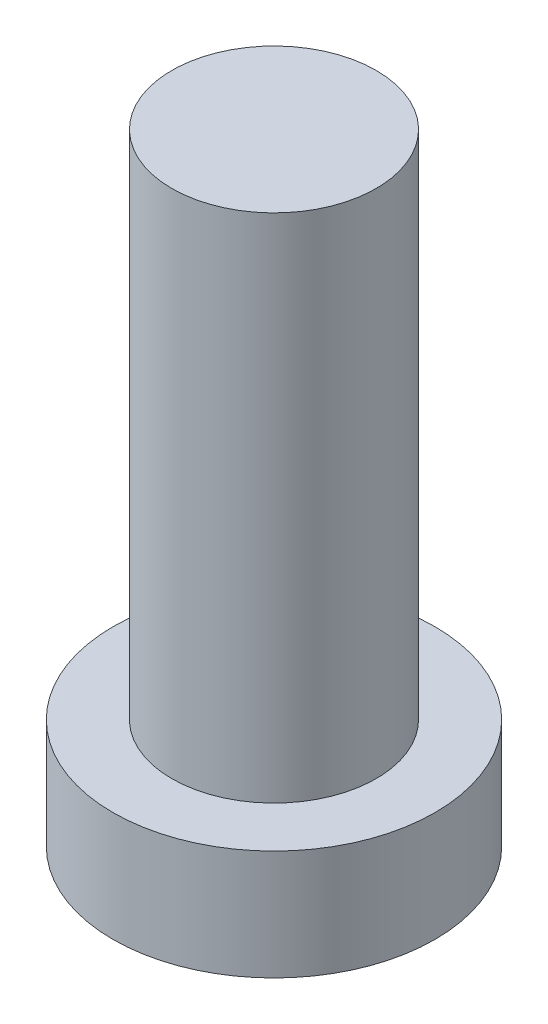
ISO-10303-21;
HEADER;
FILE_DESCRIPTION(('STEP AP214'),'2;1');
FILE_NAME('part.step','',(''),(''),'','','');
FILE_SCHEMA(('AUTOMOTIVE_DESIGN { 1 0 10303 214 1 1 1 1 }'));
ENDSEC;
DATA;
#1=APPLICATION_CONTEXT('core data for automotive mechanical design processes');
#2=APPLICATION_PROTOCOL_DEFINITION('international standard','automotive_design',2000,#1);
#3=PRODUCT_CONTEXT('',#1,'mechanical');
#4=PRODUCT('Part','Part','',(#3));
#5=PRODUCT_RELATED_PRODUCT_CATEGORY('part','',(#4));
#6=PRODUCT_DEFINITION_FORMATION('','',#4);
#7=PRODUCT_DEFINITION_CONTEXT('part definition',#1,'design');
#8=PRODUCT_DEFINITION('design','',#6,#7);
#9=PRODUCT_DEFINITION_SHAPE('','',#8);
#10=(LENGTH_UNIT() NAMED_UNIT(*) SI_UNIT(.MILLI.,.METRE.));
#11=(NAMED_UNIT(*) PLANE_ANGLE_UNIT() SI_UNIT($,.RADIAN.));
#12=(NAMED_UNIT(*) SI_UNIT($,.STERADIAN.) SOLID_ANGLE_UNIT());
#13=UNCERTAINTY_MEASURE_WITH_UNIT(LENGTH_MEASURE(1.E-05),#10,'distance_accuracy_value','');
#14=(GEOMETRIC_REPRESENTATION_CONTEXT(3) GLOBAL_UNCERTAINTY_ASSIGNED_CONTEXT((#13)) GLOBAL_UNIT_ASSIGNED_CONTEXT((#10,
#11,#12)) REPRESENTATION_CONTEXT('',''));
#15=CARTESIAN_POINT('',(0.,0.,0.));
#16=DIRECTION('',(0.,0.,1.));
#17=DIRECTION('',(1.,0.,0.));
#18=AXIS2_PLACEMENT_3D('',#15,#16,#17);
#19=CARTESIAN_POINT('',(0.,0.,0.));
#20=DIRECTION('',(0.,1.,0.));
#21=DIRECTION('',(0.,0.,1.));
#22=AXIS2_PLACEMENT_3D('',#19,#20,#21);
#23=PLANE('',#22);
#24=CARTESIAN_POINT('',(0.,0.,0.));
#25=DIRECTION('',(0.,1.,0.));
#26=DIRECTION('',(0.,0.,1.));
#27=AXIS2_PLACEMENT_3D('',#24,#25,#26);
#28=CIRCLE('',#27,3.15);
#29=CARTESIAN_POINT('',(0.,0.,3.15));
#30=VERTEX_POINT('',#29);
#31=EDGE_CURVE('E39',#30,#30,#28,.T.);
#32=ORIENTED_EDGE('',*,*,#31,.F.);
#33=EDGE_LOOP('',(#32));
#34=FACE_BOUND('',#33,.T.);
#35=CARTESIAN_POINT('',(1.,0.,1.));
#36=DIRECTION('',(0.,1.,0.));
#37=DIRECTION('',(0.,0.,-1.));
#38=AXIS2_PLACEMENT_3D('',#35,#36,#37);
#39=CIRCLE('',#38,0.5);
#40=CARTESIAN_POINT('',(1.,0.,0.5));
#41=VERTEX_POINT('',#40);
#42=CARTESIAN_POINT('',(0.5,0.,1.));
#43=VERTEX_POINT('',#42);
#44=EDGE_CURVE('E186',#41,#43,#39,.T.);
#45=ORIENTED_EDGE('',*,*,#44,.F.);
#46=DIRECTION('',(-1.,0.,0.));
#47=VECTOR('',#46,1.);
#48=CARTESIAN_POINT('',(1.,0.,0.5));
#49=LINE('',#48,#47);
#50=CARTESIAN_POINT('',(2.,0.,0.5));
#51=VERTEX_POINT('',#50);
#52=EDGE_CURVE('E52',#51,#41,#49,.T.);
#53=ORIENTED_EDGE('',*,*,#52,.F.);
#54=DIRECTION('',(0.,0.,1.));
#55=VECTOR('',#54,1.);
#56=CARTESIAN_POINT('',(2.,0.,-0.5));
#57=LINE('',#56,#55);
#58=CARTESIAN_POINT('',(2.,0.,-0.5));
#59=VERTEX_POINT('',#58);
#60=EDGE_CURVE('E225',#59,#51,#57,.T.);
#61=ORIENTED_EDGE('',*,*,#60,.F.);
#62=DIRECTION('',(1.,0.,0.));
#63=VECTOR('',#62,1.);
#64=CARTESIAN_POINT('',(1.,0.,-0.5));
#65=LINE('',#64,#63);
#66=CARTESIAN_POINT('',(1.,0.,-0.5));
#67=VERTEX_POINT('',#66);
#68=EDGE_CURVE('E223',#67,#59,#65,.T.);
#69=ORIENTED_EDGE('',*,*,#68,.F.);
#70=CARTESIAN_POINT('',(1.,0.,-1.));
#71=DIRECTION('',(0.,1.,0.));
#72=DIRECTION('',(0.,0.,-1.));
#73=AXIS2_PLACEMENT_3D('',#70,#71,#72);
#74=CIRCLE('',#73,0.5);
#75=CARTESIAN_POINT('',(0.500000000000001,0.,-1.));
#76=VERTEX_POINT('',#75);
#77=EDGE_CURVE('E160',#76,#67,#74,.T.);
#78=ORIENTED_EDGE('',*,*,#77,.F.);
#79=DIRECTION('',(0.,0.,1.));
#80=VECTOR('',#79,1.);
#81=CARTESIAN_POINT('',(0.500000000000001,0.,-2.));
#82=LINE('',#81,#80);
#83=CARTESIAN_POINT('',(0.500000000000001,0.,-2.));
#84=VERTEX_POINT('',#83);
#85=EDGE_CURVE('E219',#84,#76,#82,.T.);
#86=ORIENTED_EDGE('',*,*,#85,.F.);
#87=DIRECTION('',(1.,0.,0.));
#88=VECTOR('',#87,1.);
#89=CARTESIAN_POINT('',(-0.5,0.,-2.));
#90=LINE('',#89,#88);
#91=CARTESIAN_POINT('',(-0.5,0.,-2.));
#92=VERTEX_POINT('',#91);
#93=EDGE_CURVE('E216',#92,#84,#90,.T.);
#94=ORIENTED_EDGE('',*,*,#93,.F.);
#95=DIRECTION('',(0.,0.,-1.));
#96=VECTOR('',#95,1.);
#97=CARTESIAN_POINT('',(-0.5,0.,-2.));
#98=LINE('',#97,#96);
#99=CARTESIAN_POINT('',(-0.5,0.,-1.));
#100=VERTEX_POINT('',#99);
#101=EDGE_CURVE('E213',#100,#92,#98,.T.);
#102=ORIENTED_EDGE('',*,*,#101,.F.);
#103=CARTESIAN_POINT('',(-1.,0.,-1.));
#104=DIRECTION('',(0.,1.,0.));
#105=DIRECTION('',(0.,0.,-1.));
#106=AXIS2_PLACEMENT_3D('',#103,#104,#105);
#107=CIRCLE('',#106,0.5);
#108=CARTESIAN_POINT('',(-1.,0.,-0.5));
#109=VERTEX_POINT('',#108);
#110=EDGE_CURVE('E210',#109,#100,#107,.T.);
#111=ORIENTED_EDGE('',*,*,#110,.F.);
#112=DIRECTION('',(1.,0.,0.));
#113=VECTOR('',#112,1.);
#114=CARTESIAN_POINT('',(-2.,0.,-0.5));
#115=LINE('',#114,#113);
#116=CARTESIAN_POINT('',(-2.,0.,-0.5));
#117=VERTEX_POINT('',#116);
#118=EDGE_CURVE('E207',#117,#109,#115,.T.);
#119=ORIENTED_EDGE('',*,*,#118,.F.);
#120=DIRECTION('',(0.,0.,-1.));
#121=VECTOR('',#120,1.);
#122=CARTESIAN_POINT('',(-2.,0.,-0.5));
#123=LINE('',#122,#121);
#124=CARTESIAN_POINT('',(-2.,0.,0.5));
#125=VERTEX_POINT('',#124);
#126=EDGE_CURVE('E204',#125,#117,#123,.T.);
#127=ORIENTED_EDGE('',*,*,#126,.F.);
#128=DIRECTION('',(-1.,0.,0.));
#129=VECTOR('',#128,1.);
#130=CARTESIAN_POINT('',(-2.,0.,0.5));
#131=LINE('',#130,#129);
#132=CARTESIAN_POINT('',(-1.,0.,0.5));
#133=VERTEX_POINT('',#132);
#134=EDGE_CURVE('E201',#133,#125,#131,.T.);
#135=ORIENTED_EDGE('',*,*,#134,.F.);
#136=CARTESIAN_POINT('',(-1.,0.,1.));
#137=DIRECTION('',(0.,1.,0.));
#138=DIRECTION('',(0.,0.,1.));
#139=AXIS2_PLACEMENT_3D('',#136,#137,#138);
#140=CIRCLE('',#139,0.5);
#141=CARTESIAN_POINT('',(-0.5,0.,1.));
#142=VERTEX_POINT('',#141);
#143=EDGE_CURVE('E198',#142,#133,#140,.T.);
#144=ORIENTED_EDGE('',*,*,#143,.F.);
#145=DIRECTION('',(0.,0.,-1.));
#146=VECTOR('',#145,1.);
#147=CARTESIAN_POINT('',(-0.5,0.,1.));
#148=LINE('',#147,#146);
#149=CARTESIAN_POINT('',(-0.5,0.,2.));
#150=VERTEX_POINT('',#149);
#151=EDGE_CURVE('E195',#150,#142,#148,.T.);
#152=ORIENTED_EDGE('',*,*,#151,.F.);
#153=DIRECTION('',(-1.,0.,0.));
#154=VECTOR('',#153,1.);
#155=CARTESIAN_POINT('',(-0.5,0.,2.));
#156=LINE('',#155,#154);
#157=CARTESIAN_POINT('',(0.500000000000001,0.,2.));
#158=VERTEX_POINT('',#157);
#159=EDGE_CURVE('E192',#158,#150,#156,.T.);
#160=ORIENTED_EDGE('',*,*,#159,.F.);
#161=DIRECTION('',(0.,0.,1.));
#162=VECTOR('',#161,1.);
#163=CARTESIAN_POINT('',(0.5,0.,1.));
#164=LINE('',#163,#162);
#165=EDGE_CURVE('E189',#43,#158,#164,.T.);
#166=ORIENTED_EDGE('',*,*,#165,.F.);
#167=EDGE_LOOP('',(#45,#53,#61,#69,#78,#86,#94,#102,#111,#119,#127,#135,#144,#152,#160,#166));
#168=FACE_BOUND('',#167,.T.);
#169=ADVANCED_FACE('F35',(#34,#168),#23,.F.);
#170=CARTESIAN_POINT('',(0.,2.15,0.));
#171=DIRECTION('',(0.,-1.,0.));
#172=DIRECTION('',(0.,0.,-1.));
#173=AXIS2_PLACEMENT_3D('',#170,#171,#172);
#174=CYLINDRICAL_SURFACE('',#173,3.15);
#175=CARTESIAN_POINT('',(0.,2.15,0.));
#176=DIRECTION('',(0.,1.,0.));
#177=DIRECTION('',(0.,0.,1.));
#178=AXIS2_PLACEMENT_3D('',#175,#176,#177);
#179=CIRCLE('',#178,3.15);
#180=CARTESIAN_POINT('',(0.,2.15,3.15));
#181=VERTEX_POINT('',#180);
#182=EDGE_CURVE('E44',#181,#181,#179,.T.);
#183=ORIENTED_EDGE('',*,*,#182,.F.);
#184=EDGE_LOOP('',(#183));
#185=FACE_BOUND('',#184,.T.);
#186=ORIENTED_EDGE('',*,*,#31,.T.);
#187=EDGE_LOOP('',(#186));
#188=FACE_BOUND('',#187,.T.);
#189=ADVANCED_FACE('F37',(#185,#188),#174,.T.);
#190=CARTESIAN_POINT('',(0.,2.15,0.));
#191=DIRECTION('',(0.,1.,0.));
#192=DIRECTION('',(0.,0.,1.));
#193=AXIS2_PLACEMENT_3D('',#190,#191,#192);
#194=PLANE('',#193);
#195=CARTESIAN_POINT('',(0.,2.15,0.));
#196=DIRECTION('',(0.,1.,0.));
#197=DIRECTION('',(0.,0.,1.));
#198=AXIS2_PLACEMENT_3D('',#195,#196,#197);
#199=CIRCLE('',#198,2.);
#200=CARTESIAN_POINT('',(0.,2.15,2.));
#201=VERTEX_POINT('',#200);
#202=EDGE_CURVE('E11',#201,#201,#199,.T.);
#203=ORIENTED_EDGE('',*,*,#202,.F.);
#204=EDGE_LOOP('',(#203));
#205=FACE_BOUND('',#204,.T.);
#206=ORIENTED_EDGE('',*,*,#182,.T.);
#207=EDGE_LOOP('',(#206));
#208=FACE_BOUND('',#207,.T.);
#209=ADVANCED_FACE('F374',(#205,#208),#194,.T.);
#210=CARTESIAN_POINT('',(0.,12.15,0.));
#211=DIRECTION('',(0.,-1.,0.));
#212=DIRECTION('',(0.,0.,-1.));
#213=AXIS2_PLACEMENT_3D('',#210,#211,#212);
#214=CYLINDRICAL_SURFACE('',#213,2.);
#215=CARTESIAN_POINT('',(0.,12.15,0.));
#216=DIRECTION('',(0.,1.,0.));
#217=DIRECTION('',(0.,0.,1.));
#218=AXIS2_PLACEMENT_3D('',#215,#216,#217);
#219=CIRCLE('',#218,2.);
#220=CARTESIAN_POINT('',(0.,12.15,2.));
#221=VERTEX_POINT('',#220);
#222=EDGE_CURVE('E229',#221,#221,#219,.T.);
#223=ORIENTED_EDGE('',*,*,#222,.F.);
#224=EDGE_LOOP('',(#223));
#225=FACE_BOUND('',#224,.T.);
#226=ORIENTED_EDGE('',*,*,#202,.T.);
#227=EDGE_LOOP('',(#226));
#228=FACE_BOUND('',#227,.T.);
#229=ADVANCED_FACE('F370',(#225,#228),#214,.T.);
#230=CARTESIAN_POINT('',(0.,12.15,0.));
#231=DIRECTION('',(0.,1.,0.));
#232=DIRECTION('',(0.,0.,1.));
#233=AXIS2_PLACEMENT_3D('',#230,#231,#232);
#234=PLANE('',#233);
#235=ORIENTED_EDGE('',*,*,#222,.T.);
#236=EDGE_LOOP('',(#235));
#237=FACE_BOUND('',#236,.T.);
#238=ADVANCED_FACE('F320',(#237),#234,.T.);
#239=CARTESIAN_POINT('',(1.,1.5,0.5));
#240=DIRECTION('',(0.,0.,1.));
#241=DIRECTION('',(1.,0.,0.));
#242=AXIS2_PLACEMENT_3D('',#239,#240,#241);
#243=PLANE('',#242);
#244=ORIENTED_EDGE('',*,*,#52,.T.);
#245=DIRECTION('',(0.,-1.,0.));
#246=VECTOR('',#245,1.);
#247=CARTESIAN_POINT('',(1.,1.5,0.5));
#248=LINE('',#247,#246);
#249=CARTESIAN_POINT('',(1.,1.5,0.5));
#250=VERTEX_POINT('',#249);
#251=EDGE_CURVE('E112',#250,#41,#248,.T.);
#252=ORIENTED_EDGE('',*,*,#251,.F.);
#253=DIRECTION('',(-1.,0.,0.));
#254=VECTOR('',#253,1.);
#255=CARTESIAN_POINT('',(1.,1.5,0.5));
#256=LINE('',#255,#254);
#257=CARTESIAN_POINT('',(2.,1.5,0.5));
#258=VERTEX_POINT('',#257);
#259=EDGE_CURVE('E227',#258,#250,#256,.T.);
#260=ORIENTED_EDGE('',*,*,#259,.F.);
#261=DIRECTION('',(0.,-1.,0.));
#262=VECTOR('',#261,1.);
#263=CARTESIAN_POINT('',(2.,1.5,0.5));
#264=LINE('',#263,#262);
#265=EDGE_CURVE('E60',#258,#51,#264,.T.);
#266=ORIENTED_EDGE('',*,*,#265,.T.);
#267=EDGE_LOOP('',(#244,#252,#260,#266));
#268=FACE_BOUND('',#267,.T.);
#269=ADVANCED_FACE('F313',(#268),#243,.F.);
#270=CARTESIAN_POINT('',(2.,1.5,-0.5));
#271=DIRECTION('',(1.,0.,0.));
#272=DIRECTION('',(0.,0.,-1.));
#273=AXIS2_PLACEMENT_3D('',#270,#271,#272);
#274=PLANE('',#273);
#275=ORIENTED_EDGE('',*,*,#60,.T.);
#276=ORIENTED_EDGE('',*,*,#265,.F.);
#277=DIRECTION('',(0.,0.,1.));
#278=VECTOR('',#277,1.);
#279=CARTESIAN_POINT('',(2.,1.5,-0.5));
#280=LINE('',#279,#278);
#281=CARTESIAN_POINT('',(2.,1.5,-0.5));
#282=VERTEX_POINT('',#281);
#283=EDGE_CURVE('E172',#282,#258,#280,.T.);
#284=ORIENTED_EDGE('',*,*,#283,.F.);
#285=DIRECTION('',(0.,-1.,0.));
#286=VECTOR('',#285,1.);
#287=CARTESIAN_POINT('',(2.,1.5,-0.5));
#288=LINE('',#287,#286);
#289=EDGE_CURVE('E164',#282,#59,#288,.T.);
#290=ORIENTED_EDGE('',*,*,#289,.T.);
#291=EDGE_LOOP('',(#275,#276,#284,#290));
#292=FACE_BOUND('',#291,.T.);
#293=ADVANCED_FACE('F311',(#292),#274,.F.);
#294=CARTESIAN_POINT('',(1.,1.5,-0.5));
#295=DIRECTION('',(0.,0.,-1.));
#296=DIRECTION('',(-1.,0.,0.));
#297=AXIS2_PLACEMENT_3D('',#294,#295,#296);
#298=PLANE('',#297);
#299=ORIENTED_EDGE('',*,*,#68,.T.);
#300=ORIENTED_EDGE('',*,*,#289,.F.);
#301=DIRECTION('',(1.,0.,0.));
#302=VECTOR('',#301,1.);
#303=CARTESIAN_POINT('',(1.,1.5,-0.5));
#304=LINE('',#303,#302);
#305=CARTESIAN_POINT('',(1.,1.5,-0.5));
#306=VERTEX_POINT('',#305);
#307=EDGE_CURVE('E168',#306,#282,#304,.T.);
#308=ORIENTED_EDGE('',*,*,#307,.F.);
#309=DIRECTION('',(0.,-1.,0.));
#310=VECTOR('',#309,1.);
#311=CARTESIAN_POINT('',(1.,1.5,-0.5));
#312=LINE('',#311,#310);
#313=EDGE_CURVE('E153',#306,#67,#312,.T.);
#314=ORIENTED_EDGE('',*,*,#313,.T.);
#315=EDGE_LOOP('',(#299,#300,#308,#314));
#316=FACE_BOUND('',#315,.T.);
#317=ADVANCED_FACE('F169',(#316),#298,.F.);
#318=CARTESIAN_POINT('',(1.,1.5,-1.));
#319=DIRECTION('',(0.,-1.,0.));
#320=DIRECTION('',(0.,0.,-1.));
#321=AXIS2_PLACEMENT_3D('',#318,#319,#320);
#322=CYLINDRICAL_SURFACE('',#321,0.5);
#323=ORIENTED_EDGE('',*,*,#77,.T.);
#324=ORIENTED_EDGE('',*,*,#313,.F.);
#325=CARTESIAN_POINT('',(1.,1.5,-1.));
#326=DIRECTION('',(0.,1.,0.));
#327=DIRECTION('',(0.,0.,-1.));
#328=AXIS2_PLACEMENT_3D('',#325,#326,#327);
#329=CIRCLE('',#328,0.5);
#330=CARTESIAN_POINT('',(0.500000000000001,1.5,-1.));
#331=VERTEX_POINT('',#330);
#332=EDGE_CURVE('E157',#331,#306,#329,.T.);
#333=ORIENTED_EDGE('',*,*,#332,.F.);
#334=DIRECTION('',(0.,-1.,0.));
#335=VECTOR('',#334,1.);
#336=CARTESIAN_POINT('',(0.500000000000001,1.5,-1.));
#337=LINE('',#336,#335);
#338=EDGE_CURVE('E165',#331,#76,#337,.T.);
#339=ORIENTED_EDGE('',*,*,#338,.T.);
#340=EDGE_LOOP('',(#323,#324,#333,#339));
#341=FACE_BOUND('',#340,.T.);
#342=ADVANCED_FACE('F155',(#341),#322,.T.);
#343=CARTESIAN_POINT('',(0.500000000000001,1.5,-2.));
#344=DIRECTION('',(1.,0.,0.));
#345=DIRECTION('',(0.,0.,-1.));
#346=AXIS2_PLACEMENT_3D('',#343,#344,#345);
#347=PLANE('',#346);
#348=ORIENTED_EDGE('',*,*,#85,.T.);
#349=ORIENTED_EDGE('',*,*,#338,.F.);
#350=DIRECTION('',(0.,0.,1.));
#351=VECTOR('',#350,1.);
#352=CARTESIAN_POINT('',(0.500000000000001,1.5,-2.));
#353=LINE('',#352,#351);
#354=CARTESIAN_POINT('',(0.500000000000001,1.5,-2.));
#355=VERTEX_POINT('',#354);
#356=EDGE_CURVE('E178',#355,#331,#353,.T.);
#357=ORIENTED_EDGE('',*,*,#356,.F.);
#358=DIRECTION('',(0.,-1.,0.));
#359=VECTOR('',#358,1.);
#360=CARTESIAN_POINT('',(0.500000000000001,1.5,-2.));
#361=LINE('',#360,#359);
#362=EDGE_CURVE('E232',#355,#84,#361,.T.);
#363=ORIENTED_EDGE('',*,*,#362,.T.);
#364=EDGE_LOOP('',(#348,#349,#357,#363));
#365=FACE_BOUND('',#364,.T.);
#366=ADVANCED_FACE('F310',(#365),#347,.F.);
#367=CARTESIAN_POINT('',(-0.5,1.5,-2.));
#368=DIRECTION('',(0.,0.,-1.));
#369=DIRECTION('',(-1.,0.,0.));
#370=AXIS2_PLACEMENT_3D('',#367,#368,#369);
#371=PLANE('',#370);
#372=ORIENTED_EDGE('',*,*,#93,.T.);
#373=ORIENTED_EDGE('',*,*,#362,.F.);
#374=DIRECTION('',(1.,0.,0.));
#375=VECTOR('',#374,1.);
#376=CARTESIAN_POINT('',(-0.5,1.5,-2.));
#377=LINE('',#376,#375);
#378=CARTESIAN_POINT('',(-0.5,1.5,-2.));
#379=VERTEX_POINT('',#378);
#380=EDGE_CURVE('E180',#379,#355,#377,.T.);
#381=ORIENTED_EDGE('',*,*,#380,.F.);
#382=DIRECTION('',(0.,-1.,0.));
#383=VECTOR('',#382,1.);
#384=CARTESIAN_POINT('',(-0.5,1.5,-2.));
#385=LINE('',#384,#383);
#386=EDGE_CURVE('E234',#379,#92,#385,.T.);
#387=ORIENTED_EDGE('',*,*,#386,.T.);
#388=EDGE_LOOP('',(#372,#373,#381,#387));
#389=FACE_BOUND('',#388,.T.);
#390=ADVANCED_FACE('F306',(#389),#371,.F.);
#391=CARTESIAN_POINT('',(-0.5,1.5,-2.));
#392=DIRECTION('',(-1.,0.,0.));
#393=DIRECTION('',(0.,0.,1.));
#394=AXIS2_PLACEMENT_3D('',#391,#392,#393);
#395=PLANE('',#394);
#396=ORIENTED_EDGE('',*,*,#101,.T.);
#397=ORIENTED_EDGE('',*,*,#386,.F.);
#398=DIRECTION('',(0.,0.,-1.));
#399=VECTOR('',#398,1.);
#400=CARTESIAN_POINT('',(-0.5,1.5,-2.));
#401=LINE('',#400,#399);
#402=CARTESIAN_POINT('',(-0.5,1.5,-1.));
#403=VERTEX_POINT('',#402);
#404=EDGE_CURVE('E301',#403,#379,#401,.T.);
#405=ORIENTED_EDGE('',*,*,#404,.F.);
#406=DIRECTION('',(0.,-1.,0.));
#407=VECTOR('',#406,1.);
#408=CARTESIAN_POINT('',(-0.5,1.5,-1.));
#409=LINE('',#408,#407);
#410=EDGE_CURVE('E236',#403,#100,#409,.T.);
#411=ORIENTED_EDGE('',*,*,#410,.T.);
#412=EDGE_LOOP('',(#396,#397,#405,#411));
#413=FACE_BOUND('',#412,.T.);
#414=ADVANCED_FACE('F330',(#413),#395,.F.);
#415=CARTESIAN_POINT('',(-1.,1.5,-1.));
#416=DIRECTION('',(0.,-1.,0.));
#417=DIRECTION('',(0.,0.,-1.));
#418=AXIS2_PLACEMENT_3D('',#415,#416,#417);
#419=CYLINDRICAL_SURFACE('',#418,0.5);
#420=ORIENTED_EDGE('',*,*,#110,.T.);
#421=ORIENTED_EDGE('',*,*,#410,.F.);
#422=CARTESIAN_POINT('',(-1.,1.5,-1.));
#423=DIRECTION('',(0.,1.,0.));
#424=DIRECTION('',(0.,0.,-1.));
#425=AXIS2_PLACEMENT_3D('',#422,#423,#424);
#426=CIRCLE('',#425,0.5);
#427=CARTESIAN_POINT('',(-1.,1.5,-0.5));
#428=VERTEX_POINT('',#427);
#429=EDGE_CURVE('E298',#428,#403,#426,.T.);
#430=ORIENTED_EDGE('',*,*,#429,.F.);
#431=DIRECTION('',(0.,-1.,0.));
#432=VECTOR('',#431,1.);
#433=CARTESIAN_POINT('',(-1.,1.5,-0.5));
#434=LINE('',#433,#432);
#435=EDGE_CURVE('E238',#428,#109,#434,.T.);
#436=ORIENTED_EDGE('',*,*,#435,.T.);
#437=EDGE_LOOP('',(#420,#421,#430,#436));
#438=FACE_BOUND('',#437,.T.);
#439=ADVANCED_FACE('F333',(#438),#419,.T.);
#440=CARTESIAN_POINT('',(-2.,1.5,-0.5));
#441=DIRECTION('',(0.,0.,-1.));
#442=DIRECTION('',(-1.,0.,0.));
#443=AXIS2_PLACEMENT_3D('',#440,#441,#442);
#444=PLANE('',#443);
#445=ORIENTED_EDGE('',*,*,#118,.T.);
#446=ORIENTED_EDGE('',*,*,#435,.F.);
#447=DIRECTION('',(1.,0.,0.));
#448=VECTOR('',#447,1.);
#449=CARTESIAN_POINT('',(-2.,1.5,-0.5));
#450=LINE('',#449,#448);
#451=CARTESIAN_POINT('',(-2.,1.5,-0.5));
#452=VERTEX_POINT('',#451);
#453=EDGE_CURVE('E295',#452,#428,#450,.T.);
#454=ORIENTED_EDGE('',*,*,#453,.F.);
#455=DIRECTION('',(0.,-1.,0.));
#456=VECTOR('',#455,1.);
#457=CARTESIAN_POINT('',(-2.,1.5,-0.5));
#458=LINE('',#457,#456);
#459=EDGE_CURVE('E240',#452,#117,#458,.T.);
#460=ORIENTED_EDGE('',*,*,#459,.T.);
#461=EDGE_LOOP('',(#445,#446,#454,#460));
#462=FACE_BOUND('',#461,.T.);
#463=ADVANCED_FACE('F337',(#462),#444,.F.);
#464=CARTESIAN_POINT('',(-2.,1.5,-0.5));
#465=DIRECTION('',(-1.,0.,0.));
#466=DIRECTION('',(0.,0.,1.));
#467=AXIS2_PLACEMENT_3D('',#464,#465,#466);
#468=PLANE('',#467);
#469=ORIENTED_EDGE('',*,*,#126,.T.);
#470=ORIENTED_EDGE('',*,*,#459,.F.);
#471=DIRECTION('',(0.,0.,-1.));
#472=VECTOR('',#471,1.);
#473=CARTESIAN_POINT('',(-2.,1.5,-0.5));
#474=LINE('',#473,#472);
#475=CARTESIAN_POINT('',(-2.,1.5,0.5));
#476=VERTEX_POINT('',#475);
#477=EDGE_CURVE('E292',#476,#452,#474,.T.);
#478=ORIENTED_EDGE('',*,*,#477,.F.);
#479=DIRECTION('',(0.,-1.,0.));
#480=VECTOR('',#479,1.);
#481=CARTESIAN_POINT('',(-2.,1.5,0.5));
#482=LINE('',#481,#480);
#483=EDGE_CURVE('E242',#476,#125,#482,.T.);
#484=ORIENTED_EDGE('',*,*,#483,.T.);
#485=EDGE_LOOP('',(#469,#470,#478,#484));
#486=FACE_BOUND('',#485,.T.);
#487=ADVANCED_FACE('F341',(#486),#468,.F.);
#488=CARTESIAN_POINT('',(-2.,1.5,0.5));
#489=DIRECTION('',(0.,0.,1.));
#490=DIRECTION('',(1.,0.,0.));
#491=AXIS2_PLACEMENT_3D('',#488,#489,#490);
#492=PLANE('',#491);
#493=ORIENTED_EDGE('',*,*,#134,.T.);
#494=ORIENTED_EDGE('',*,*,#483,.F.);
#495=DIRECTION('',(-1.,0.,0.));
#496=VECTOR('',#495,1.);
#497=CARTESIAN_POINT('',(-2.,1.5,0.5));
#498=LINE('',#497,#496);
#499=CARTESIAN_POINT('',(-1.,1.5,0.5));
#500=VERTEX_POINT('',#499);
#501=EDGE_CURVE('E289',#500,#476,#498,.T.);
#502=ORIENTED_EDGE('',*,*,#501,.F.);
#503=DIRECTION('',(0.,-1.,0.));
#504=VECTOR('',#503,1.);
#505=CARTESIAN_POINT('',(-1.,1.5,0.5));
#506=LINE('',#505,#504);
#507=EDGE_CURVE('E244',#500,#133,#506,.T.);
#508=ORIENTED_EDGE('',*,*,#507,.T.);
#509=EDGE_LOOP('',(#493,#494,#502,#508));
#510=FACE_BOUND('',#509,.T.);
#511=ADVANCED_FACE('F345',(#510),#492,.F.);
#512=CARTESIAN_POINT('',(-1.,1.5,1.));
#513=DIRECTION('',(0.,-1.,0.));
#514=DIRECTION('',(0.,0.,-1.));
#515=AXIS2_PLACEMENT_3D('',#512,#513,#514);
#516=CYLINDRICAL_SURFACE('',#515,0.5);
#517=ORIENTED_EDGE('',*,*,#143,.T.);
#518=ORIENTED_EDGE('',*,*,#507,.F.);
#519=CARTESIAN_POINT('',(-1.,1.5,1.));
#520=DIRECTION('',(0.,1.,0.));
#521=DIRECTION('',(0.,0.,1.));
#522=AXIS2_PLACEMENT_3D('',#519,#520,#521);
#523=CIRCLE('',#522,0.5);
#524=CARTESIAN_POINT('',(-0.5,1.5,1.));
#525=VERTEX_POINT('',#524);
#526=EDGE_CURVE('E286',#525,#500,#523,.T.);
#527=ORIENTED_EDGE('',*,*,#526,.F.);
#528=DIRECTION('',(0.,-1.,0.));
#529=VECTOR('',#528,1.);
#530=CARTESIAN_POINT('',(-0.5,1.5,1.));
#531=LINE('',#530,#529);
#532=EDGE_CURVE('E246',#525,#142,#531,.T.);
#533=ORIENTED_EDGE('',*,*,#532,.T.);
#534=EDGE_LOOP('',(#517,#518,#527,#533));
#535=FACE_BOUND('',#534,.T.);
#536=ADVANCED_FACE('F349',(#535),#516,.T.);
#537=CARTESIAN_POINT('',(-0.5,1.5,1.));
#538=DIRECTION('',(-1.,0.,0.));
#539=DIRECTION('',(0.,0.,1.));
#540=AXIS2_PLACEMENT_3D('',#537,#538,#539);
#541=PLANE('',#540);
#542=ORIENTED_EDGE('',*,*,#151,.T.);
#543=ORIENTED_EDGE('',*,*,#532,.F.);
#544=DIRECTION('',(0.,0.,-1.));
#545=VECTOR('',#544,1.);
#546=CARTESIAN_POINT('',(-0.5,1.5,1.));
#547=LINE('',#546,#545);
#548=CARTESIAN_POINT('',(-0.5,1.5,2.));
#549=VERTEX_POINT('',#548);
#550=EDGE_CURVE('E283',#549,#525,#547,.T.);
#551=ORIENTED_EDGE('',*,*,#550,.F.);
#552=DIRECTION('',(0.,-1.,0.));
#553=VECTOR('',#552,1.);
#554=CARTESIAN_POINT('',(-0.5,1.5,2.));
#555=LINE('',#554,#553);
#556=EDGE_CURVE('E248',#549,#150,#555,.T.);
#557=ORIENTED_EDGE('',*,*,#556,.T.);
#558=EDGE_LOOP('',(#542,#543,#551,#557));
#559=FACE_BOUND('',#558,.T.);
#560=ADVANCED_FACE('F353',(#559),#541,.F.);
#561=CARTESIAN_POINT('',(-0.5,1.5,2.));
#562=DIRECTION('',(0.,0.,1.));
#563=DIRECTION('',(1.,0.,0.));
#564=AXIS2_PLACEMENT_3D('',#561,#562,#563);
#565=PLANE('',#564);
#566=ORIENTED_EDGE('',*,*,#159,.T.);
#567=ORIENTED_EDGE('',*,*,#556,.F.);
#568=DIRECTION('',(-1.,0.,0.));
#569=VECTOR('',#568,1.);
#570=CARTESIAN_POINT('',(-0.5,1.5,2.));
#571=LINE('',#570,#569);
#572=CARTESIAN_POINT('',(0.500000000000001,1.5,2.));
#573=VERTEX_POINT('',#572);
#574=EDGE_CURVE('E280',#573,#549,#571,.T.);
#575=ORIENTED_EDGE('',*,*,#574,.F.);
#576=DIRECTION('',(0.,-1.,0.));
#577=VECTOR('',#576,1.);
#578=CARTESIAN_POINT('',(0.500000000000001,1.5,2.));
#579=LINE('',#578,#577);
#580=EDGE_CURVE('E250',#573,#158,#579,.T.);
#581=ORIENTED_EDGE('',*,*,#580,.T.);
#582=EDGE_LOOP('',(#566,#567,#575,#581));
#583=FACE_BOUND('',#582,.T.);
#584=ADVANCED_FACE('F357',(#583),#565,.F.);
#585=CARTESIAN_POINT('',(0.5,1.5,1.));
#586=DIRECTION('',(1.,0.,0.));
#587=DIRECTION('',(0.,0.,-1.));
#588=AXIS2_PLACEMENT_3D('',#585,#586,#587);
#589=PLANE('',#588);
#590=ORIENTED_EDGE('',*,*,#165,.T.);
#591=ORIENTED_EDGE('',*,*,#580,.F.);
#592=DIRECTION('',(0.,0.,1.));
#593=VECTOR('',#592,1.);
#594=CARTESIAN_POINT('',(0.5,1.5,1.));
#595=LINE('',#594,#593);
#596=CARTESIAN_POINT('',(0.5,1.5,1.));
#597=VERTEX_POINT('',#596);
#598=EDGE_CURVE('E275',#597,#573,#595,.T.);
#599=ORIENTED_EDGE('',*,*,#598,.F.);
#600=DIRECTION('',(0.,-1.,0.));
#601=VECTOR('',#600,1.);
#602=CARTESIAN_POINT('',(0.5,1.5,1.));
#603=LINE('',#602,#601);
#604=EDGE_CURVE('E252',#597,#43,#603,.T.);
#605=ORIENTED_EDGE('',*,*,#604,.T.);
#606=EDGE_LOOP('',(#590,#591,#599,#605));
#607=FACE_BOUND('',#606,.T.);
#608=ADVANCED_FACE('F361',(#607),#589,.F.);
#609=CARTESIAN_POINT('',(1.,1.5,1.));
#610=DIRECTION('',(0.,-1.,0.));
#611=DIRECTION('',(0.,0.,-1.));
#612=AXIS2_PLACEMENT_3D('',#609,#610,#611);
#613=CYLINDRICAL_SURFACE('',#612,0.5);
#614=ORIENTED_EDGE('',*,*,#44,.T.);
#615=ORIENTED_EDGE('',*,*,#604,.F.);
#616=CARTESIAN_POINT('',(1.,1.5,1.));
#617=DIRECTION('',(0.,1.,0.));
#618=DIRECTION('',(0.,0.,-1.));
#619=AXIS2_PLACEMENT_3D('',#616,#617,#618);
#620=CIRCLE('',#619,0.5);
#621=EDGE_CURVE('E273',#250,#597,#620,.T.);
#622=ORIENTED_EDGE('',*,*,#621,.F.);
#623=ORIENTED_EDGE('',*,*,#251,.T.);
#624=EDGE_LOOP('',(#614,#615,#622,#623));
#625=FACE_BOUND('',#624,.T.);
#626=ADVANCED_FACE('F270',(#625),#613,.T.);
#627=CARTESIAN_POINT('',(1.,1.5,-1.));
#628=DIRECTION('',(0.,-1.,0.));
#629=DIRECTION('',(0.,0.,-1.));
#630=AXIS2_PLACEMENT_3D('',#627,#628,#629);
#631=PLANE('',#630);
#632=ORIENTED_EDGE('',*,*,#259,.T.);
#633=ORIENTED_EDGE('',*,*,#621,.T.);
#634=ORIENTED_EDGE('',*,*,#598,.T.);
#635=ORIENTED_EDGE('',*,*,#574,.T.);
#636=ORIENTED_EDGE('',*,*,#550,.T.);
#637=ORIENTED_EDGE('',*,*,#526,.T.);
#638=ORIENTED_EDGE('',*,*,#501,.T.);
#639=ORIENTED_EDGE('',*,*,#477,.T.);
#640=ORIENTED_EDGE('',*,*,#453,.T.);
#641=ORIENTED_EDGE('',*,*,#429,.T.);
#642=ORIENTED_EDGE('',*,*,#404,.T.);
#643=ORIENTED_EDGE('',*,*,#380,.T.);
#644=ORIENTED_EDGE('',*,*,#356,.T.);
#645=ORIENTED_EDGE('',*,*,#332,.T.);
#646=ORIENTED_EDGE('',*,*,#307,.T.);
#647=ORIENTED_EDGE('',*,*,#283,.T.);
#648=EDGE_LOOP('',(#632,#633,#634,#635,#636,#637,#638,#639,#640,#641,#642,#643,#644,#645,#646,#647));
#649=FACE_BOUND('',#648,.T.);
#650=ADVANCED_FACE('F175',(#649),#631,.T.);
#651=CLOSED_SHELL('',(#169,#189,#209,#229,#238,#269,#293,#317,#342,#366,#390,#414,#439,#463,
#487,#511,#536,#560,#584,#608,#626,#650));
#652=MANIFOLD_SOLID_BREP('B2',#651);
#653=ADVANCED_BREP_SHAPE_REPRESENTATION('',(#18,#652),#14);
#654=SHAPE_DEFINITION_REPRESENTATION(#9,#653);
ENDSEC;
END-ISO-10303-21;
